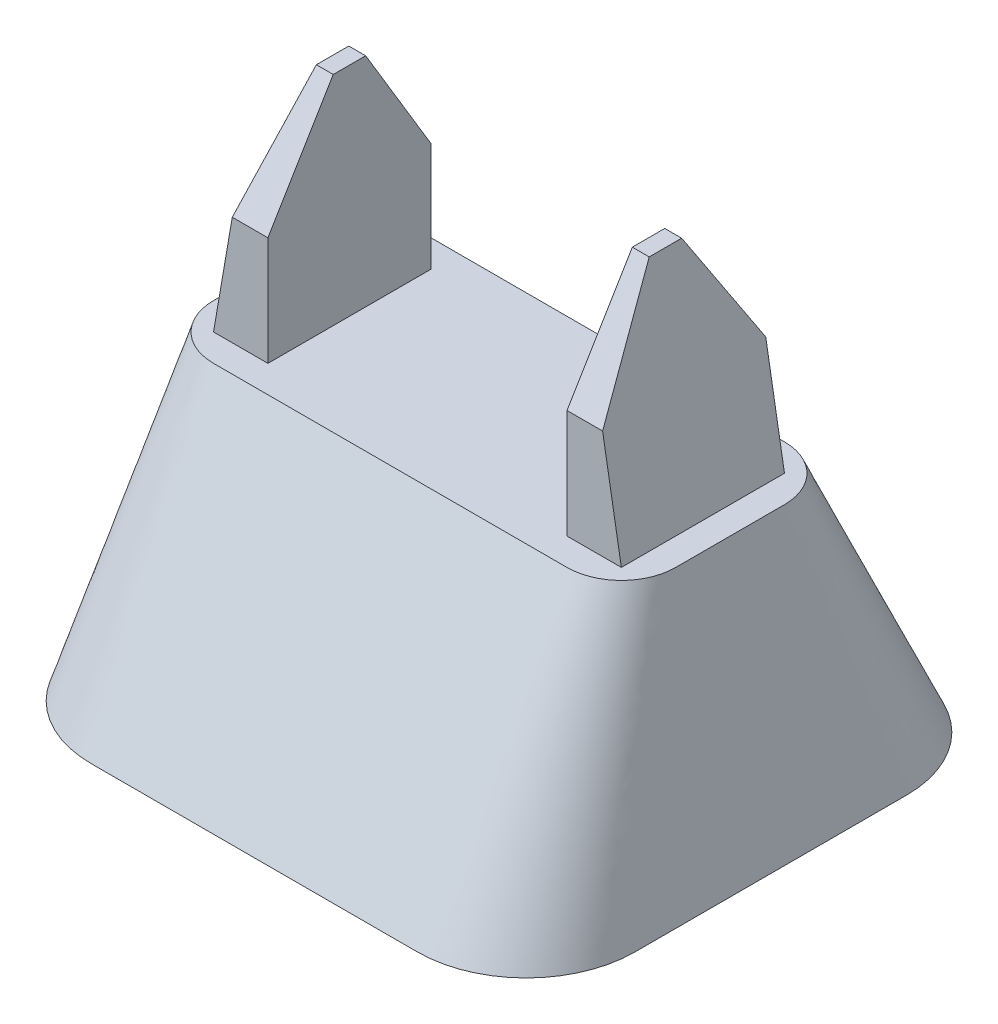
ISO-10303-21;
HEADER;
FILE_DESCRIPTION(('STEP AP214'),'2;1');
FILE_NAME('part.step','',(''),(''),'','','');
FILE_SCHEMA(('AUTOMOTIVE_DESIGN { 1 0 10303 214 1 1 1 1 }'));
ENDSEC;
DATA;
#1=APPLICATION_CONTEXT('core data for automotive mechanical design processes');
#2=APPLICATION_PROTOCOL_DEFINITION('international standard','automotive_design',2000,#1);
#3=PRODUCT_CONTEXT('',#1,'mechanical');
#4=PRODUCT('Part','Part','',(#3));
#5=PRODUCT_RELATED_PRODUCT_CATEGORY('part','',(#4));
#6=PRODUCT_DEFINITION_FORMATION('','',#4);
#7=PRODUCT_DEFINITION_CONTEXT('part definition',#1,'design');
#8=PRODUCT_DEFINITION('design','',#6,#7);
#9=PRODUCT_DEFINITION_SHAPE('','',#8);
#10=(LENGTH_UNIT() NAMED_UNIT(*) SI_UNIT(.MILLI.,.METRE.));
#11=(NAMED_UNIT(*) PLANE_ANGLE_UNIT() SI_UNIT($,.RADIAN.));
#12=(NAMED_UNIT(*) SI_UNIT($,.STERADIAN.) SOLID_ANGLE_UNIT());
#13=UNCERTAINTY_MEASURE_WITH_UNIT(LENGTH_MEASURE(1.E-05),#10,'distance_accuracy_value','');
#14=(GEOMETRIC_REPRESENTATION_CONTEXT(3) GLOBAL_UNCERTAINTY_ASSIGNED_CONTEXT((#13)) GLOBAL_UNIT_ASSIGNED_CONTEXT((#10,
#11,#12)) REPRESENTATION_CONTEXT('',''));
#15=CARTESIAN_POINT('',(0.,0.,0.));
#16=DIRECTION('',(0.,0.,1.));
#17=DIRECTION('',(1.,0.,0.));
#18=AXIS2_PLACEMENT_3D('',#15,#16,#17);
#19=CARTESIAN_POINT('',(37.5,90.,15.));
#20=DIRECTION('',(0.,0.,1.));
#21=DIRECTION('',(1.,0.,0.));
#22=AXIS2_PLACEMENT_3D('',#19,#20,#21);
#23=PLANE('',#22);
#24=DIRECTION('',(-1.,0.,0.));
#25=VECTOR('',#24,1.);
#26=CARTESIAN_POINT('',(37.5,50.,15.));
#27=LINE('',#26,#25);
#28=CARTESIAN_POINT('',(37.5,50.,15.));
#29=VERTEX_POINT('',#28);
#30=CARTESIAN_POINT('',(27.5,50.,15.));
#31=VERTEX_POINT('',#30);
#32=EDGE_CURVE('E396',#29,#31,#27,.T.);
#33=ORIENTED_EDGE('',*,*,#32,.F.);
#34=DIRECTION('',(-0.16979012859174,0.985480244466017,0.));
#35=VECTOR('',#34,1.);
#36=CARTESIAN_POINT('',(37.5,50.,15.));
#37=LINE('',#36,#35);
#38=CARTESIAN_POINT('',(34.0541647426176,69.9999999999999,15.));
#39=VERTEX_POINT('',#38);
#40=EDGE_CURVE('E378',#29,#39,#37,.T.);
#41=ORIENTED_EDGE('',*,*,#40,.T.);
#42=DIRECTION('',(-1.,0.,0.));
#43=VECTOR('',#42,1.);
#44=CARTESIAN_POINT('',(27.5,69.9999999999999,15.));
#45=LINE('',#44,#43);
#46=CARTESIAN_POINT('',(27.5,69.9999999999999,15.));
#47=VERTEX_POINT('',#46);
#48=EDGE_CURVE('E701',#39,#47,#45,.T.);
#49=ORIENTED_EDGE('',*,*,#48,.T.);
#50=DIRECTION('',(0.,-1.,0.));
#51=VECTOR('',#50,1.);
#52=CARTESIAN_POINT('',(27.5,90.,15.));
#53=LINE('',#52,#51);
#54=EDGE_CURVE('E403',#47,#31,#53,.T.);
#55=ORIENTED_EDGE('',*,*,#54,.T.);
#56=EDGE_LOOP('',(#33,#41,#49,#55));
#57=FACE_BOUND('',#56,.T.);
#58=ADVANCED_FACE('F239',(#57),#23,.T.);
#59=CARTESIAN_POINT('',(37.5,90.,-15.));
#60=DIRECTION('',(0.,0.,-1.));
#61=DIRECTION('',(-1.,0.,0.));
#62=AXIS2_PLACEMENT_3D('',#59,#60,#61);
#63=PLANE('',#62);
#64=DIRECTION('',(1.,0.,0.));
#65=VECTOR('',#64,1.);
#66=CARTESIAN_POINT('',(37.5,69.9999999999999,-15.));
#67=LINE('',#66,#65);
#68=CARTESIAN_POINT('',(27.5,69.9999999999999,-15.));
#69=VERTEX_POINT('',#68);
#70=CARTESIAN_POINT('',(34.0541647426176,69.9999999999999,-15.));
#71=VERTEX_POINT('',#70);
#72=EDGE_CURVE('E251',#69,#71,#67,.T.);
#73=ORIENTED_EDGE('',*,*,#72,.T.);
#74=DIRECTION('',(0.16979012859174,-0.985480244466017,0.));
#75=VECTOR('',#74,1.);
#76=CARTESIAN_POINT('',(30.8070073026998,88.846852489312,-15.));
#77=LINE('',#76,#75);
#78=CARTESIAN_POINT('',(37.5,50.,-15.));
#79=VERTEX_POINT('',#78);
#80=EDGE_CURVE('E258',#71,#79,#77,.T.);
#81=ORIENTED_EDGE('',*,*,#80,.T.);
#82=DIRECTION('',(1.,0.,0.));
#83=VECTOR('',#82,1.);
#84=CARTESIAN_POINT('',(37.5,50.,-15.));
#85=LINE('',#84,#83);
#86=CARTESIAN_POINT('',(27.5,50.,-15.));
#87=VERTEX_POINT('',#86);
#88=EDGE_CURVE('E399',#87,#79,#85,.T.);
#89=ORIENTED_EDGE('',*,*,#88,.F.);
#90=DIRECTION('',(0.,-1.,0.));
#91=VECTOR('',#90,1.);
#92=CARTESIAN_POINT('',(27.5,90.,-15.));
#93=LINE('',#92,#91);
#94=EDGE_CURVE('E418',#69,#87,#93,.T.);
#95=ORIENTED_EDGE('',*,*,#94,.F.);
#96=EDGE_LOOP('',(#73,#81,#89,#95));
#97=FACE_BOUND('',#96,.T.);
#98=ADVANCED_FACE('F720',(#97),#63,.T.);
#99=CARTESIAN_POINT('',(0.,90.,0.));
#100=DIRECTION('',(0.,-1.,0.));
#101=DIRECTION('',(0.,0.,-1.));
#102=AXIS2_PLACEMENT_3D('',#99,#100,#101);
#103=PLANE('',#102);
#104=DIRECTION('',(0.,0.,1.));
#105=VECTOR('',#104,1.);
#106=CARTESIAN_POINT('',(30.6083294852352,90.,-45.0074659097587));
#107=LINE('',#106,#105);
#108=CARTESIAN_POINT('',(30.6083294852352,90.,-2.98278761944878));
#109=VERTEX_POINT('',#108);
#110=CARTESIAN_POINT('',(30.6083294852352,90.,2.98278761944879));
#111=VERTEX_POINT('',#110);
#112=EDGE_CURVE('E388',#109,#111,#107,.T.);
#113=ORIENTED_EDGE('',*,*,#112,.F.);
#114=DIRECTION('',(-1.,0.,0.));
#115=VECTOR('',#114,1.);
#116=CARTESIAN_POINT('',(27.5,90.,-2.98278761944878));
#117=LINE('',#116,#115);
#118=CARTESIAN_POINT('',(27.5,90.,-2.98278761944878));
#119=VERTEX_POINT('',#118);
#120=EDGE_CURVE('E709',#109,#119,#117,.T.);
#121=ORIENTED_EDGE('',*,*,#120,.T.);
#122=DIRECTION('',(0.,0.,-1.));
#123=VECTOR('',#122,1.);
#124=CARTESIAN_POINT('',(27.5,90.,-15.));
#125=LINE('',#124,#123);
#126=CARTESIAN_POINT('',(27.5,90.,2.98278761944879));
#127=VERTEX_POINT('',#126);
#128=EDGE_CURVE('E409',#127,#119,#125,.T.);
#129=ORIENTED_EDGE('',*,*,#128,.F.);
#130=DIRECTION('',(1.,0.,0.));
#131=VECTOR('',#130,1.);
#132=CARTESIAN_POINT('',(37.5,90.,2.98278761944879));
#133=LINE('',#132,#131);
#134=EDGE_CURVE('E712',#127,#111,#133,.T.);
#135=ORIENTED_EDGE('',*,*,#134,.T.);
#136=EDGE_LOOP('',(#113,#121,#129,#135));
#137=FACE_BOUND('',#136,.T.);
#138=ADVANCED_FACE('F725',(#137),#103,.F.);
#139=CARTESIAN_POINT('',(37.5,69.9999999999999,15.));
#140=DIRECTION('',(0.,0.515038074910052,0.857167300702113));
#141=DIRECTION('',(1.,0.,0.));
#142=AXIS2_PLACEMENT_3D('',#139,#140,#141);
#143=PLANE('',#142);
#144=ORIENTED_EDGE('',*,*,#48,.F.);
#145=DIRECTION('',(-0.146098240937858,0.847969969689386,-0.509511760904344));
#146=VECTOR('',#145,1.);
#147=CARTESIAN_POINT('',(34.1277150486702,69.5731060798972,15.256503745092));
#148=LINE('',#147,#146);
#149=EDGE_CURVE('E383',#39,#111,#148,.T.);
#150=ORIENTED_EDGE('',*,*,#149,.T.);
#151=ORIENTED_EDGE('',*,*,#134,.F.);
#152=DIRECTION('',(0.,0.857167300702113,-0.515038074910052));
#153=VECTOR('',#152,1.);
#154=CARTESIAN_POINT('',(27.5,97.9389295207428,-1.78740248680088));
#155=LINE('',#154,#153);
#156=EDGE_CURVE('E706',#47,#127,#155,.T.);
#157=ORIENTED_EDGE('',*,*,#156,.F.);
#158=EDGE_LOOP('',(#144,#150,#151,#157));
#159=FACE_BOUND('',#158,.T.);
#160=ADVANCED_FACE('F734',(#159),#143,.T.);
#161=CARTESIAN_POINT('',(37.5,69.9999999999999,-15.));
#162=DIRECTION('',(0.,0.515038074910052,-0.857167300702113));
#163=DIRECTION('',(-1.,0.,0.));
#164=AXIS2_PLACEMENT_3D('',#161,#162,#163);
#165=PLANE('',#164);
#166=ORIENTED_EDGE('',*,*,#120,.F.);
#167=DIRECTION('',(0.146098240937858,-0.847969969689386,-0.509511760904344));
#168=VECTOR('',#167,1.);
#169=CARTESIAN_POINT('',(34.1277150486702,69.5731060798971,-15.256503745092));
#170=LINE('',#169,#168);
#171=EDGE_CURVE('E12',#109,#71,#170,.T.);
#172=ORIENTED_EDGE('',*,*,#171,.T.);
#173=ORIENTED_EDGE('',*,*,#72,.F.);
#174=DIRECTION('',(0.,-0.857167300702113,-0.515038074910052));
#175=VECTOR('',#174,1.);
#176=CARTESIAN_POINT('',(27.5,84.6947156278589,-6.1705240714107));
#177=LINE('',#176,#175);
#178=EDGE_CURVE('E265',#119,#69,#177,.T.);
#179=ORIENTED_EDGE('',*,*,#178,.F.);
#180=EDGE_LOOP('',(#166,#172,#173,#179));
#181=FACE_BOUND('',#180,.T.);
#182=ADVANCED_FACE('F242',(#181),#165,.T.);
#183=CARTESIAN_POINT('',(32.5,50.,10.));
#184=DIRECTION('',(0.,1.,0.));
#185=DIRECTION('',(0.,0.,1.));
#186=AXIS2_PLACEMENT_3D('',#183,#184,#185);
#187=PLANE('',#186);
#188=CARTESIAN_POINT('',(32.5,50.,-10.));
#189=DIRECTION('',(0.,1.,0.));
#190=DIRECTION('',(0.,0.,-1.));
#191=AXIS2_PLACEMENT_3D('',#188,#189,#190);
#192=CIRCLE('',#191,10.);
#193=CARTESIAN_POINT('',(42.5,50.,-9.9999999999969));
#194=VERTEX_POINT('',#193);
#195=CARTESIAN_POINT('',(32.4999999999959,50.,-20.));
#196=VERTEX_POINT('',#195);
#197=EDGE_CURVE('E244',#194,#196,#192,.T.);
#198=ORIENTED_EDGE('',*,*,#197,.T.);
#199=DIRECTION('',(-1.,0.,0.));
#200=VECTOR('',#199,1.);
#201=CARTESIAN_POINT('',(-32.4999999999999,50.,-20.));
#202=LINE('',#201,#200);
#203=CARTESIAN_POINT('',(-32.4999999999986,50.,-20.));
#204=VERTEX_POINT('',#203);
#205=EDGE_CURVE('E698',#196,#204,#202,.T.);
#206=ORIENTED_EDGE('',*,*,#205,.T.);
#207=CARTESIAN_POINT('',(-32.5,50.,-10.));
#208=DIRECTION('',(0.,1.,0.));
#209=DIRECTION('',(0.,0.,1.));
#210=AXIS2_PLACEMENT_3D('',#207,#208,#209);
#211=CIRCLE('',#210,10.);
#212=CARTESIAN_POINT('',(-42.5,50.,-9.999999999979));
#213=VERTEX_POINT('',#212);
#214=EDGE_CURVE('E688',#204,#213,#211,.T.);
#215=ORIENTED_EDGE('',*,*,#214,.T.);
#216=DIRECTION('',(0.,0.,1.));
#217=VECTOR('',#216,1.);
#218=CARTESIAN_POINT('',(-42.5,50.,-9.99999999999993));
#219=LINE('',#218,#217);
#220=CARTESIAN_POINT('',(-42.5,50.,9.9999999999969));
#221=VERTEX_POINT('',#220);
#222=EDGE_CURVE('E678',#213,#221,#219,.T.);
#223=ORIENTED_EDGE('',*,*,#222,.T.);
#224=CARTESIAN_POINT('',(-32.5,50.,10.));
#225=DIRECTION('',(0.,1.,0.));
#226=DIRECTION('',(0.,0.,1.));
#227=AXIS2_PLACEMENT_3D('',#224,#225,#226);
#228=CIRCLE('',#227,10.);
#229=CARTESIAN_POINT('',(-32.4999999999999,50.,20.));
#230=VERTEX_POINT('',#229);
#231=EDGE_CURVE('E574',#221,#230,#228,.T.);
#232=ORIENTED_EDGE('',*,*,#231,.T.);
#233=DIRECTION('',(1.,0.,0.));
#234=VECTOR('',#233,1.);
#235=CARTESIAN_POINT('',(-32.4999999999999,50.,20.));
#236=LINE('',#235,#234);
#237=CARTESIAN_POINT('',(32.4999999999999,50.,20.));
#238=VERTEX_POINT('',#237);
#239=EDGE_CURVE('E677',#230,#238,#236,.T.);
#240=ORIENTED_EDGE('',*,*,#239,.T.);
#241=CARTESIAN_POINT('',(32.5,50.,10.));
#242=DIRECTION('',(0.,1.,0.));
#243=DIRECTION('',(0.,0.,1.));
#244=AXIS2_PLACEMENT_3D('',#241,#242,#243);
#245=CIRCLE('',#244,10.);
#246=CARTESIAN_POINT('',(42.5,50.,9.99999999997901));
#247=VERTEX_POINT('',#246);
#248=EDGE_CURVE('E591',#238,#247,#245,.T.);
#249=ORIENTED_EDGE('',*,*,#248,.T.);
#250=DIRECTION('',(0.,0.,-1.));
#251=VECTOR('',#250,1.);
#252=CARTESIAN_POINT('',(42.5,50.,-9.99999999999993));
#253=LINE('',#252,#251);
#254=EDGE_CURVE('E811',#247,#194,#253,.T.);
#255=ORIENTED_EDGE('',*,*,#254,.T.);
#256=EDGE_LOOP('',(#198,#206,#215,#223,#232,#240,#249,#255));
#257=FACE_BOUND('',#256,.T.);
#258=ORIENTED_EDGE('',*,*,#32,.T.);
#259=DIRECTION('',(0.,0.,-1.));
#260=VECTOR('',#259,1.);
#261=CARTESIAN_POINT('',(27.5,50.,-15.));
#262=LINE('',#261,#260);
#263=EDGE_CURVE('E413',#31,#87,#262,.T.);
#264=ORIENTED_EDGE('',*,*,#263,.T.);
#265=ORIENTED_EDGE('',*,*,#88,.T.);
#266=DIRECTION('',(0.,0.,1.));
#267=VECTOR('',#266,1.);
#268=CARTESIAN_POINT('',(37.5,50.,-15.));
#269=LINE('',#268,#267);
#270=EDGE_CURVE('E381',#79,#29,#269,.T.);
#271=ORIENTED_EDGE('',*,*,#270,.T.);
#272=EDGE_LOOP('',(#258,#264,#265,#271));
#273=FACE_BOUND('',#272,.T.);
#274=DIRECTION('',(0.,0.,-1.));
#275=VECTOR('',#274,1.);
#276=CARTESIAN_POINT('',(-27.5,50.,-15.));
#277=LINE('',#276,#275);
#278=CARTESIAN_POINT('',(-27.5,50.,15.));
#279=VERTEX_POINT('',#278);
#280=CARTESIAN_POINT('',(-27.5,50.,-15.));
#281=VERTEX_POINT('',#280);
#282=EDGE_CURVE('E445',#279,#281,#277,.T.);
#283=ORIENTED_EDGE('',*,*,#282,.F.);
#284=DIRECTION('',(1.,0.,0.));
#285=VECTOR('',#284,1.);
#286=CARTESIAN_POINT('',(-37.5,50.,15.));
#287=LINE('',#286,#285);
#288=CARTESIAN_POINT('',(-37.5,50.,15.));
#289=VERTEX_POINT('',#288);
#290=EDGE_CURVE('E435',#289,#279,#287,.T.);
#291=ORIENTED_EDGE('',*,*,#290,.F.);
#292=DIRECTION('',(0.,0.,1.));
#293=VECTOR('',#292,1.);
#294=CARTESIAN_POINT('',(-37.5,50.,-15.));
#295=LINE('',#294,#293);
#296=CARTESIAN_POINT('',(-37.5,50.,-15.));
#297=VERTEX_POINT('',#296);
#298=EDGE_CURVE('E441',#297,#289,#295,.T.);
#299=ORIENTED_EDGE('',*,*,#298,.F.);
#300=DIRECTION('',(-1.,0.,0.));
#301=VECTOR('',#300,1.);
#302=CARTESIAN_POINT('',(-37.5,50.,-15.));
#303=LINE('',#302,#301);
#304=EDGE_CURVE('E449',#281,#297,#303,.T.);
#305=ORIENTED_EDGE('',*,*,#304,.F.);
#306=EDGE_LOOP('',(#283,#291,#299,#305));
#307=FACE_BOUND('',#306,.T.);
#308=ADVANCED_FACE('F393',(#257,#273,#307),#187,.T.);
#309=CARTESIAN_POINT('',(-30.,0.,25.));
#310=DIRECTION('',(0.,1.,0.));
#311=DIRECTION('',(0.,0.,1.));
#312=AXIS2_PLACEMENT_3D('',#309,#310,#311);
#313=PLANE('',#312);
#314=CARTESIAN_POINT('',(-30.,0.,25.));
#315=DIRECTION('',(0.,1.,0.));
#316=DIRECTION('',(0.,0.,1.));
#317=AXIS2_PLACEMENT_3D('',#314,#315,#316);
#318=CIRCLE('',#317,20.);
#319=CARTESIAN_POINT('',(-50.,0.,24.9999999999999));
#320=VERTEX_POINT('',#319);
#321=CARTESIAN_POINT('',(-29.9999999999999,0.,45.));
#322=VERTEX_POINT('',#321);
#323=EDGE_CURVE('E460',#320,#322,#318,.T.);
#324=ORIENTED_EDGE('',*,*,#323,.F.);
#325=DIRECTION('',(0.,0.,1.));
#326=VECTOR('',#325,1.);
#327=CARTESIAN_POINT('',(-50.,0.,-24.9999999999999));
#328=LINE('',#327,#326);
#329=CARTESIAN_POINT('',(-50.,0.,-24.9999999999999));
#330=VERTEX_POINT('',#329);
#331=EDGE_CURVE('E465',#330,#320,#328,.T.);
#332=ORIENTED_EDGE('',*,*,#331,.F.);
#333=CARTESIAN_POINT('',(-30.,0.,-25.));
#334=DIRECTION('',(0.,1.,0.));
#335=DIRECTION('',(0.,0.,1.));
#336=AXIS2_PLACEMENT_3D('',#333,#334,#335);
#337=CIRCLE('',#336,20.);
#338=CARTESIAN_POINT('',(-29.9999999999999,0.,-45.));
#339=VERTEX_POINT('',#338);
#340=EDGE_CURVE('E592',#339,#330,#337,.T.);
#341=ORIENTED_EDGE('',*,*,#340,.F.);
#342=DIRECTION('',(-1.,0.,0.));
#343=VECTOR('',#342,1.);
#344=CARTESIAN_POINT('',(-29.9999999999999,0.,-45.));
#345=LINE('',#344,#343);
#346=CARTESIAN_POINT('',(29.9999999999999,0.,-45.));
#347=VERTEX_POINT('',#346);
#348=EDGE_CURVE('E610',#347,#339,#345,.T.);
#349=ORIENTED_EDGE('',*,*,#348,.F.);
#350=CARTESIAN_POINT('',(30.,0.,-25.));
#351=DIRECTION('',(0.,1.,0.));
#352=DIRECTION('',(0.,0.,-1.));
#353=AXIS2_PLACEMENT_3D('',#350,#351,#352);
#354=CIRCLE('',#353,20.);
#355=CARTESIAN_POINT('',(50.,0.,-24.9999999999999));
#356=VERTEX_POINT('',#355);
#357=EDGE_CURVE('E614',#356,#347,#354,.T.);
#358=ORIENTED_EDGE('',*,*,#357,.F.);
#359=DIRECTION('',(0.,0.,-1.));
#360=VECTOR('',#359,1.);
#361=CARTESIAN_POINT('',(50.,0.,-24.9999999999999));
#362=LINE('',#361,#360);
#363=CARTESIAN_POINT('',(50.,0.,24.9999999999999));
#364=VERTEX_POINT('',#363);
#365=EDGE_CURVE('E632',#364,#356,#362,.T.);
#366=ORIENTED_EDGE('',*,*,#365,.F.);
#367=CARTESIAN_POINT('',(30.,0.,25.));
#368=DIRECTION('',(0.,1.,0.));
#369=DIRECTION('',(0.,0.,1.));
#370=AXIS2_PLACEMENT_3D('',#367,#368,#369);
#371=CIRCLE('',#370,20.);
#372=CARTESIAN_POINT('',(29.9999999999999,0.,45.));
#373=VERTEX_POINT('',#372);
#374=EDGE_CURVE('E636',#373,#364,#371,.T.);
#375=ORIENTED_EDGE('',*,*,#374,.F.);
#376=DIRECTION('',(1.,0.,0.));
#377=VECTOR('',#376,1.);
#378=CARTESIAN_POINT('',(-29.9999999999999,0.,45.));
#379=LINE('',#378,#377);
#380=EDGE_CURVE('E654',#322,#373,#379,.T.);
#381=ORIENTED_EDGE('',*,*,#380,.F.);
#382=EDGE_LOOP('',(#324,#332,#341,#349,#358,#366,#375,#381));
#383=FACE_BOUND('',#382,.T.);
#384=ADVANCED_FACE('F485',(#383),#313,.F.);
#385=CARTESIAN_POINT('',(29.9999999945337,0.,45.));
#386=CARTESIAN_POINT('',(32.4999999951741,50.,20.));
#387=CARTESIAN_POINT('',(30.9870004315935,0.,45.));
#388=CARTESIAN_POINT('',(33.371388581805,50.,20.));
#389=CARTESIAN_POINT('',(33.0461220397606,0.,44.8543372343022));
#390=CARTESIAN_POINT('',(34.9569066435373,50.0000000000001,19.7791154950756));
#391=CARTESIAN_POINT('',(36.3391748458526,0.,44.0779320833664));
#392=CARTESIAN_POINT('',(36.971178624645,49.9999999999999,19.0236673784884));
#393=CARTESIAN_POINT('',(39.7313876841015,0.,42.6133924469578));
#394=CARTESIAN_POINT('',(38.6603146068333,50.0000000000002,17.9561301170677));
#395=CARTESIAN_POINT('',(43.0410145022343,0.,40.3515992818675));
#396=CARTESIAN_POINT('',(40.0432788309345,49.9999999999998,16.6524540542411));
#397=CARTESIAN_POINT('',(46.0020912776037,0.,37.260797420792));
#398=CARTESIAN_POINT('',(41.1269771982851,50.0000000000001,15.1650579210531));
#399=CARTESIAN_POINT('',(48.3064308131088,0.,33.4585062740194));
#400=CARTESIAN_POINT('',(41.9104560096727,50.,13.5372761554775));
#401=CARTESIAN_POINT('',(49.7109552899609,0.,29.2322450000357));
#402=CARTESIAN_POINT('',(42.3905385378229,50.,11.8059752513497));
#403=CARTESIAN_POINT('',(50.,0.,26.3812788407832));
#404=CARTESIAN_POINT('',(42.5,50.,10.6058108801075));
#405=CARTESIAN_POINT('',(50.,0.,20.9778971548833));
#406=CARTESIAN_POINT('',(42.5,50.,8.23595816243623));
#407=CARTESIAN_POINT('',(50.,0.,12.7283971027914));
#408=CARTESIAN_POINT('',(42.5,50.,4.86584216101014));
#409=CARTESIAN_POINT('',(50.,0.,0.));
#410=CARTESIAN_POINT('',(42.5,50.,0.));
#411=CARTESIAN_POINT('',(50.,0.,-12.7283971027914));
#412=CARTESIAN_POINT('',(42.5,50.,-4.86584216101016));
#413=CARTESIAN_POINT('',(50.,0.,-20.9778971548833));
#414=CARTESIAN_POINT('',(42.5,50.,-8.23595816243623));
#415=CARTESIAN_POINT('',(50.,0.,-26.3812788407832));
#416=CARTESIAN_POINT('',(42.5,50.,-10.6058108801075));
#417=CARTESIAN_POINT('',(49.710955289961,0.,-29.2322450000357));
#418=CARTESIAN_POINT('',(42.390538537823,50.,-11.8059752513497));
#419=CARTESIAN_POINT('',(48.3064308131087,0.,-33.4585062740193));
#420=CARTESIAN_POINT('',(41.9104560096728,50.,-13.5372761554775));
#421=CARTESIAN_POINT('',(46.0020912776038,0.,-37.2607974207919));
#422=CARTESIAN_POINT('',(41.1269771982849,50.,-15.165057921053));
#423=CARTESIAN_POINT('',(43.0410145022344,0.,-40.3515992818675));
#424=CARTESIAN_POINT('',(40.0432788309348,49.9999999999999,-16.6524540542411));
#425=CARTESIAN_POINT('',(39.7313876841015,0.,-42.6133924469578));
#426=CARTESIAN_POINT('',(38.6603146068332,50.0000000000001,-17.9561301170676));
#427=CARTESIAN_POINT('',(36.3391748458527,0.,-44.0779320833664));
#428=CARTESIAN_POINT('',(36.9711786246452,49.9999999999999,-19.0236673784884));
#429=CARTESIAN_POINT('',(33.0461220397607,0.,-44.8543372343022));
#430=CARTESIAN_POINT('',(34.9569066435372,50.0000000000001,-19.7791154950756));
#431=CARTESIAN_POINT('',(30.9870004315936,0.,-45.));
#432=CARTESIAN_POINT('',(33.371388581805,50.,-20.));
#433=CARTESIAN_POINT('',(24.3560069980397,0.,-45.));
#434=CARTESIAN_POINT('',(27.5171135692872,50.,-20.));
#435=CARTESIAN_POINT('',(14.1963766322911,0.,-45.));
#436=CARTESIAN_POINT('',(16.984807252091,50.,-20.));
#437=CARTESIAN_POINT('',(0.,0.,-45.));
#438=CARTESIAN_POINT('',(0.,50.,-20.));
#439=CARTESIAN_POINT('',(-14.196376632291,0.,-45.));
#440=CARTESIAN_POINT('',(-16.984807252091,50.,-20.));
#441=CARTESIAN_POINT('',(-24.3560069980397,0.,-45.));
#442=CARTESIAN_POINT('',(-27.5171135692871,50.,-20.));
#443=CARTESIAN_POINT('',(-30.9870004315935,0.,-45.));
#444=CARTESIAN_POINT('',(-33.371388581805,50.,-20.));
#445=CARTESIAN_POINT('',(-33.0461220397606,0.,-44.8543372343022));
#446=CARTESIAN_POINT('',(-34.9569066435373,50.0000000000001,-19.7791154950757));
#447=CARTESIAN_POINT('',(-36.3391748458526,0.,-44.0779320833665));
#448=CARTESIAN_POINT('',(-36.971178624645,50.,-19.0236673784884));
#449=CARTESIAN_POINT('',(-39.7313876841014,0.,-42.6133924469577));
#450=CARTESIAN_POINT('',(-38.6603146068333,50.,-17.9561301170677));
#451=CARTESIAN_POINT('',(-43.0410145022344,0.,-40.3515992818676));
#452=CARTESIAN_POINT('',(-40.0432788309347,50.0000000000001,-16.6524540542411));
#453=CARTESIAN_POINT('',(-46.0020912776036,0.,-37.2607974207919));
#454=CARTESIAN_POINT('',(-41.1269771982849,49.9999999999999,-15.165057921053));
#455=CARTESIAN_POINT('',(-48.3064308131089,0.,-33.4585062740194));
#456=CARTESIAN_POINT('',(-41.9104560096728,50.0000000000001,-13.5372761554775));
#457=CARTESIAN_POINT('',(-49.7109552899608,0.,-29.2322450000357));
#458=CARTESIAN_POINT('',(-42.3905385378229,50.,-11.8059752513497));
#459=CARTESIAN_POINT('',(-50.,0.,-26.3812788407832));
#460=CARTESIAN_POINT('',(-42.5,50.,-10.6058108801075));
#461=CARTESIAN_POINT('',(-50.,0.,-20.9778971548833));
#462=CARTESIAN_POINT('',(-42.5,50.,-8.23595816243622));
#463=CARTESIAN_POINT('',(-50.,0.,-12.7283971027914));
#464=CARTESIAN_POINT('',(-42.5,50.,-4.86584216101014));
#465=CARTESIAN_POINT('',(-50.,0.,0.));
#466=CARTESIAN_POINT('',(-42.5,50.,0.));
#467=CARTESIAN_POINT('',(-50.,0.,12.7283971027914));
#468=CARTESIAN_POINT('',(-42.5,50.,4.86584216101014));
#469=CARTESIAN_POINT('',(-50.,0.,20.9778971548833));
#470=CARTESIAN_POINT('',(-42.5,50.,8.23595816243622));
#471=CARTESIAN_POINT('',(-50.,0.,26.3812788407832));
#472=CARTESIAN_POINT('',(-42.5,50.,10.6058108801075));
#473=CARTESIAN_POINT('',(-49.7109552899609,0.,29.2322450000357));
#474=CARTESIAN_POINT('',(-42.3905385378229,50.0000000000001,11.8059752513497));
#475=CARTESIAN_POINT('',(-48.3064308131088,0.,33.4585062740193));
#476=CARTESIAN_POINT('',(-41.9104560096728,50.0000000000001,13.5372761554775));
#477=CARTESIAN_POINT('',(-46.0020912776037,0.,37.260797420792));
#478=CARTESIAN_POINT('',(-41.126977198285,49.9999999999998,15.165057921053));
#479=CARTESIAN_POINT('',(-43.0410145022344,0.,40.3515992818675));
#480=CARTESIAN_POINT('',(-40.0432788309346,50.0000000000001,16.6524540542411));
#481=CARTESIAN_POINT('',(-39.7313876841015,0.,42.6133924469577));
#482=CARTESIAN_POINT('',(-38.6603146068333,50.,17.9561301170676));
#483=CARTESIAN_POINT('',(-36.3391748458527,0.,44.0779320833664));
#484=CARTESIAN_POINT('',(-36.9711786246452,50.,19.0236673784884));
#485=CARTESIAN_POINT('',(-33.0461220397607,0.,44.8543372343022));
#486=CARTESIAN_POINT('',(-34.9569066435372,49.9999999999999,19.7791154950755));
#487=CARTESIAN_POINT('',(-30.9870004315936,0.,45.));
#488=CARTESIAN_POINT('',(-33.371388581805,50.,20.));
#489=CARTESIAN_POINT('',(-24.3560069980397,0.,45.));
#490=CARTESIAN_POINT('',(-27.5171135692872,50.,20.));
#491=CARTESIAN_POINT('',(-14.1963766322911,0.,45.0000000000001));
#492=CARTESIAN_POINT('',(-16.984807252091,50.,20.));
#493=CARTESIAN_POINT('',(0.,0.,44.9999999999999));
#494=CARTESIAN_POINT('',(0.,50.,20.));
#495=CARTESIAN_POINT('',(14.1963766322911,0.,45.0000000000001));
#496=CARTESIAN_POINT('',(16.984807252091,50.,20.));
#497=CARTESIAN_POINT('',(24.3560069980397,0.,45.));
#498=CARTESIAN_POINT('',(27.5171135692872,50.,20.));
#499=CARTESIAN_POINT('',(29.9999999945337,0.,45.));
#500=CARTESIAN_POINT('',(32.4999999951741,50.,20.));
#501=B_SPLINE_SURFACE_WITH_KNOTS('',3,1,((#385,#386),(#387,#388),(#389,#390),(#391,#392),(#393,
#394),(#395,#396),(#397,#398),(#399,#400),(#401,#402),(#403,#404),(#405,#406),(#407,#408),(#409,
#410),(#411,#412),(#413,#414),(#415,#416),(#417,#418),(#419,#420),(#421,#422),(#423,#424),(#425,
#426),(#427,#428),(#429,#430),(#431,#432),(#433,#434),(#435,#436),(#437,#438),(#439,#440),(#441,
#442),(#443,#444),(#445,#446),(#447,#448),(#449,#450),(#451,#452),(#453,#454),(#455,#456),(#457,
#458),(#459,#460),(#461,#462),(#463,#464),(#465,#466),(#467,#468),(#469,#470),(#471,#472),(#473,
#474),(#475,#476),(#477,#478),(#479,#480),(#481,#482),(#483,#484),(#485,#486),(#487,#488),(#489,
#490),(#491,#492),(#493,#494),(#495,#496),(#497,#498),(#499,#500)),.UNSPECIFIED.,.T.,.F.,.F.,(4,
1,1,1,1,1,1,1,2,1,1,1,2,1,1,1,1,1,1,1,2,1,1,1,2,1,1,1,1,1,1,1,2,1,1,1,2,1,1,1,1,1,1,1,2,1,1,1,
4),(2,2),(0.,0.00989691561643741,0.0197938312328748,0.0296907468493122,0.0395876624657496,
0.049484578082187,0.0593814936986244,0.0692784093150618,0.0791753249314993,0.107993845149453,
0.136812365367408,0.165630885585362,0.194449405803316,0.204346321419753,0.214243237036191,
0.224140152652628,0.234037068269065,0.243933983885503,0.25383089950194,0.263727815118378,
0.273624730734815,0.330218548051111,0.386812365367407,0.443406182683704,0.5,0.509896915616437,
0.519793831232875,0.529690746849312,0.53958766246575,0.549484578082187,0.559381493698624,
0.569278409315062,0.579175324931499,0.607993845149453,0.636812365367408,0.665630885585362,
0.694449405803316,0.704346321419753,0.714243237036191,0.724140152652628,0.734037068269065,
0.743933983885503,0.75383089950194,0.763727815118378,0.773624730734815,0.830218548051111,
0.886812365367407,0.943406182683704,1.),(0.,1.),.UNSPECIFIED.);
#502=ORIENTED_EDGE('',*,*,#331,.T.);
#503=ORIENTED_EDGE('',*,*,#323,.T.);
#504=ORIENTED_EDGE('',*,*,#380,.T.);
#505=ORIENTED_EDGE('',*,*,#374,.T.);
#506=ORIENTED_EDGE('',*,*,#365,.T.);
#507=ORIENTED_EDGE('',*,*,#357,.T.);
#508=ORIENTED_EDGE('',*,*,#348,.T.);
#509=ORIENTED_EDGE('',*,*,#340,.T.);
#510=EDGE_LOOP('',(#502,#503,#504,#505,#506,#507,#508,#509));
#511=FACE_BOUND('',#510,.T.);
#512=ORIENTED_EDGE('',*,*,#231,.F.);
#513=ORIENTED_EDGE('',*,*,#222,.F.);
#514=ORIENTED_EDGE('',*,*,#214,.F.);
#515=ORIENTED_EDGE('',*,*,#205,.F.);
#516=ORIENTED_EDGE('',*,*,#197,.F.);
#517=ORIENTED_EDGE('',*,*,#254,.F.);
#518=ORIENTED_EDGE('',*,*,#248,.F.);
#519=ORIENTED_EDGE('',*,*,#239,.F.);
#520=EDGE_LOOP('',(#512,#513,#514,#515,#516,#517,#518,#519));
#521=FACE_BOUND('',#520,.T.);
#522=ADVANCED_FACE('F472',(#511,#521),#501,.T.);
#523=CARTESIAN_POINT('',(-37.5,90.,15.));
#524=DIRECTION('',(0.,0.,-1.));
#525=DIRECTION('',(-1.,0.,0.));
#526=AXIS2_PLACEMENT_3D('',#523,#524,#525);
#527=PLANE('',#526);
#528=DIRECTION('',(-1.,0.,0.));
#529=VECTOR('',#528,1.);
#530=CARTESIAN_POINT('',(-37.5,69.9999999999999,15.));
#531=LINE('',#530,#529);
#532=CARTESIAN_POINT('',(-27.5,69.9999999999999,15.));
#533=VERTEX_POINT('',#532);
#534=CARTESIAN_POINT('',(-34.0541647426176,69.9999999999999,15.));
#535=VERTEX_POINT('',#534);
#536=EDGE_CURVE('E775',#533,#535,#531,.T.);
#537=ORIENTED_EDGE('',*,*,#536,.T.);
#538=DIRECTION('',(0.16979012859174,0.985480244466017,0.));
#539=VECTOR('',#538,1.);
#540=CARTESIAN_POINT('',(-37.5,50.,15.));
#541=LINE('',#540,#539);
#542=EDGE_CURVE('E421',#289,#535,#541,.T.);
#543=ORIENTED_EDGE('',*,*,#542,.F.);
#544=ORIENTED_EDGE('',*,*,#290,.T.);
#545=DIRECTION('',(0.,-1.,0.));
#546=VECTOR('',#545,1.);
#547=CARTESIAN_POINT('',(-27.5,90.,15.));
#548=LINE('',#547,#546);
#549=EDGE_CURVE('E457',#533,#279,#548,.T.);
#550=ORIENTED_EDGE('',*,*,#549,.F.);
#551=EDGE_LOOP('',(#537,#543,#544,#550));
#552=FACE_BOUND('',#551,.T.);
#553=ADVANCED_FACE('F484',(#552),#527,.F.);
#554=CARTESIAN_POINT('',(-27.5,90.,-15.));
#555=DIRECTION('',(-1.,0.,0.));
#556=DIRECTION('',(0.,0.,1.));
#557=AXIS2_PLACEMENT_3D('',#554,#555,#556);
#558=PLANE('',#557);
#559=DIRECTION('',(0.,0.,-1.));
#560=VECTOR('',#559,1.);
#561=CARTESIAN_POINT('',(-27.5,90.,-15.));
#562=LINE('',#561,#560);
#563=CARTESIAN_POINT('',(-27.5,90.,2.98278761944879));
#564=VERTEX_POINT('',#563);
#565=CARTESIAN_POINT('',(-27.5,90.,-2.98278761944878));
#566=VERTEX_POINT('',#565);
#567=EDGE_CURVE('E436',#564,#566,#562,.T.);
#568=ORIENTED_EDGE('',*,*,#567,.F.);
#569=DIRECTION('',(0.,0.857167300702113,-0.515038074910052));
#570=VECTOR('',#569,1.);
#571=CARTESIAN_POINT('',(-27.5,90.,2.98278761944879));
#572=LINE('',#571,#570);
#573=EDGE_CURVE('E782',#564,#533,#572,.F.);
#574=ORIENTED_EDGE('',*,*,#573,.T.);
#575=ORIENTED_EDGE('',*,*,#549,.T.);
#576=ORIENTED_EDGE('',*,*,#282,.T.);
#577=DIRECTION('',(0.,-1.,0.));
#578=VECTOR('',#577,1.);
#579=CARTESIAN_POINT('',(-27.5,90.,-15.));
#580=LINE('',#579,#578);
#581=CARTESIAN_POINT('',(-27.5,69.9999999999999,-15.));
#582=VERTEX_POINT('',#581);
#583=EDGE_CURVE('E440',#582,#281,#580,.T.);
#584=ORIENTED_EDGE('',*,*,#583,.F.);
#585=DIRECTION('',(0.,-0.857167300702113,-0.515038074910052));
#586=VECTOR('',#585,1.);
#587=CARTESIAN_POINT('',(-27.5,90.,-2.98278761944878));
#588=LINE('',#587,#586);
#589=EDGE_CURVE('E786',#582,#566,#588,.F.);
#590=ORIENTED_EDGE('',*,*,#589,.T.);
#591=EDGE_LOOP('',(#568,#574,#575,#576,#584,#590));
#592=FACE_BOUND('',#591,.T.);
#593=ADVANCED_FACE('F763',(#592),#558,.F.);
#594=CARTESIAN_POINT('',(-37.5,90.,-15.));
#595=DIRECTION('',(0.,0.,1.));
#596=DIRECTION('',(1.,0.,0.));
#597=AXIS2_PLACEMENT_3D('',#594,#595,#596);
#598=PLANE('',#597);
#599=ORIENTED_EDGE('',*,*,#304,.T.);
#600=DIRECTION('',(0.16979012859174,0.985480244466017,0.));
#601=VECTOR('',#600,1.);
#602=CARTESIAN_POINT('',(-30.8070073026998,88.846852489312,-15.));
#603=LINE('',#602,#601);
#604=CARTESIAN_POINT('',(-34.0541647426176,69.9999999999999,-15.));
#605=VERTEX_POINT('',#604);
#606=EDGE_CURVE('E428',#297,#605,#603,.T.);
#607=ORIENTED_EDGE('',*,*,#606,.T.);
#608=DIRECTION('',(1.,0.,0.));
#609=VECTOR('',#608,1.);
#610=CARTESIAN_POINT('',(-37.5,69.9999999999999,-15.));
#611=LINE('',#610,#609);
#612=EDGE_CURVE('E781',#605,#582,#611,.T.);
#613=ORIENTED_EDGE('',*,*,#612,.T.);
#614=ORIENTED_EDGE('',*,*,#583,.T.);
#615=EDGE_LOOP('',(#599,#607,#613,#614));
#616=FACE_BOUND('',#615,.T.);
#617=ADVANCED_FACE('F759',(#616),#598,.F.);
#618=CARTESIAN_POINT('',(0.,90.,0.));
#619=DIRECTION('',(0.,-1.,0.));
#620=DIRECTION('',(0.,0.,-1.));
#621=AXIS2_PLACEMENT_3D('',#618,#619,#620);
#622=PLANE('',#621);
#623=DIRECTION('',(-1.,0.,0.));
#624=VECTOR('',#623,1.);
#625=CARTESIAN_POINT('',(0.,90.,-2.98278761944878));
#626=LINE('',#625,#624);
#627=CARTESIAN_POINT('',(-30.6083294852352,90.,-2.98278761944878));
#628=VERTEX_POINT('',#627);
#629=EDGE_CURVE('E794',#566,#628,#626,.T.);
#630=ORIENTED_EDGE('',*,*,#629,.T.);
#631=DIRECTION('',(0.,0.,1.));
#632=VECTOR('',#631,1.);
#633=CARTESIAN_POINT('',(-30.6083294852352,90.,-45.0074659097587));
#634=LINE('',#633,#632);
#635=CARTESIAN_POINT('',(-30.6083294852352,90.,2.98278761944879));
#636=VERTEX_POINT('',#635);
#637=EDGE_CURVE('E424',#628,#636,#634,.T.);
#638=ORIENTED_EDGE('',*,*,#637,.T.);
#639=DIRECTION('',(1.,0.,0.));
#640=VECTOR('',#639,1.);
#641=CARTESIAN_POINT('',(0.,90.,2.98278761944879));
#642=LINE('',#641,#640);
#643=EDGE_CURVE('E791',#636,#564,#642,.T.);
#644=ORIENTED_EDGE('',*,*,#643,.T.);
#645=ORIENTED_EDGE('',*,*,#567,.T.);
#646=EDGE_LOOP('',(#630,#638,#644,#645));
#647=FACE_BOUND('',#646,.T.);
#648=ADVANCED_FACE('F755',(#647),#622,.F.);
#649=CARTESIAN_POINT('',(0.,90.,2.98278761944879));
#650=DIRECTION('',(0.,-0.515038074910052,-0.857167300702113));
#651=DIRECTION('',(1.,0.,0.));
#652=AXIS2_PLACEMENT_3D('',#649,#650,#651);
#653=PLANE('',#652);
#654=DIRECTION('',(-0.146098240937858,-0.847969969689386,0.509511760904344));
#655=VECTOR('',#654,1.);
#656=CARTESIAN_POINT('',(-29.9550039971478,93.7919716950351,0.704341159435028));
#657=LINE('',#656,#655);
#658=EDGE_CURVE('E432',#535,#636,#657,.F.);
#659=ORIENTED_EDGE('',*,*,#658,.F.);
#660=ORIENTED_EDGE('',*,*,#536,.F.);
#661=ORIENTED_EDGE('',*,*,#573,.F.);
#662=ORIENTED_EDGE('',*,*,#643,.F.);
#663=EDGE_LOOP('',(#659,#660,#661,#662));
#664=FACE_BOUND('',#663,.T.);
#665=ADVANCED_FACE('F758',(#664),#653,.F.);
#666=CARTESIAN_POINT('',(0.,90.,-2.98278761944878));
#667=DIRECTION('',(0.,-0.515038074910052,0.857167300702113));
#668=DIRECTION('',(-1.,0.,0.));
#669=AXIS2_PLACEMENT_3D('',#666,#667,#668);
#670=PLANE('',#669);
#671=DIRECTION('',(0.146098240937858,0.847969969689386,0.509511760904344));
#672=VECTOR('',#671,1.);
#673=CARTESIAN_POINT('',(-29.9550039971478,93.7919716950351,-0.704341159435016));
#674=LINE('',#673,#672);
#675=EDGE_CURVE('E699',#628,#605,#674,.F.);
#676=ORIENTED_EDGE('',*,*,#675,.F.);
#677=ORIENTED_EDGE('',*,*,#629,.F.);
#678=ORIENTED_EDGE('',*,*,#589,.F.);
#679=ORIENTED_EDGE('',*,*,#612,.F.);
#680=EDGE_LOOP('',(#676,#677,#678,#679));
#681=FACE_BOUND('',#680,.T.);
#682=ADVANCED_FACE('F744',(#681),#670,.F.);
#683=CARTESIAN_POINT('',(-37.5,50.,-45.0074659097587));
#684=DIRECTION('',(0.985480244466017,-0.16979012859174,0.));
#685=DIRECTION('',(0.16979012859174,0.985480244466017,0.));
#686=AXIS2_PLACEMENT_3D('',#683,#684,#685);
#687=PLANE('',#686);
#688=ORIENTED_EDGE('',*,*,#658,.T.);
#689=ORIENTED_EDGE('',*,*,#637,.F.);
#690=ORIENTED_EDGE('',*,*,#675,.T.);
#691=ORIENTED_EDGE('',*,*,#606,.F.);
#692=ORIENTED_EDGE('',*,*,#298,.T.);
#693=ORIENTED_EDGE('',*,*,#542,.T.);
#694=EDGE_LOOP('',(#688,#689,#690,#691,#692,#693));
#695=FACE_BOUND('',#694,.T.);
#696=ADVANCED_FACE('F737',(#695),#687,.F.);
#697=CARTESIAN_POINT('',(27.5,90.,-15.));
#698=DIRECTION('',(-1.,0.,0.));
#699=DIRECTION('',(0.,0.,1.));
#700=AXIS2_PLACEMENT_3D('',#697,#698,#699);
#701=PLANE('',#700);
#702=ORIENTED_EDGE('',*,*,#54,.F.);
#703=ORIENTED_EDGE('',*,*,#156,.T.);
#704=ORIENTED_EDGE('',*,*,#128,.T.);
#705=ORIENTED_EDGE('',*,*,#178,.T.);
#706=ORIENTED_EDGE('',*,*,#94,.T.);
#707=ORIENTED_EDGE('',*,*,#263,.F.);
#708=EDGE_LOOP('',(#702,#703,#704,#705,#706,#707));
#709=FACE_BOUND('',#708,.T.);
#710=ADVANCED_FACE('F735',(#709),#701,.T.);
#711=CARTESIAN_POINT('',(37.5,50.,-45.0074659097587));
#712=DIRECTION('',(0.985480244466017,0.16979012859174,0.));
#713=DIRECTION('',(-0.16979012859174,0.985480244466017,0.));
#714=AXIS2_PLACEMENT_3D('',#711,#712,#713);
#715=PLANE('',#714);
#716=ORIENTED_EDGE('',*,*,#40,.F.);
#717=ORIENTED_EDGE('',*,*,#270,.F.);
#718=ORIENTED_EDGE('',*,*,#80,.F.);
#719=ORIENTED_EDGE('',*,*,#171,.F.);
#720=ORIENTED_EDGE('',*,*,#112,.T.);
#721=ORIENTED_EDGE('',*,*,#149,.F.);
#722=EDGE_LOOP('',(#716,#717,#718,#719,#720,#721));
#723=FACE_BOUND('',#722,.T.);
#724=ADVANCED_FACE('F380',(#723),#715,.T.);
#725=CLOSED_SHELL('',(#58,#98,#138,#160,#182,#308,#384,#522,#553,#593,#617,#648,#665,#682,#696,
#710,#724));
#726=MANIFOLD_SOLID_BREP('B2',#725);
#727=ADVANCED_BREP_SHAPE_REPRESENTATION('',(#18,#726),#14);
#728=SHAPE_DEFINITION_REPRESENTATION(#9,#727);
ENDSEC;
END-ISO-10303-21;
